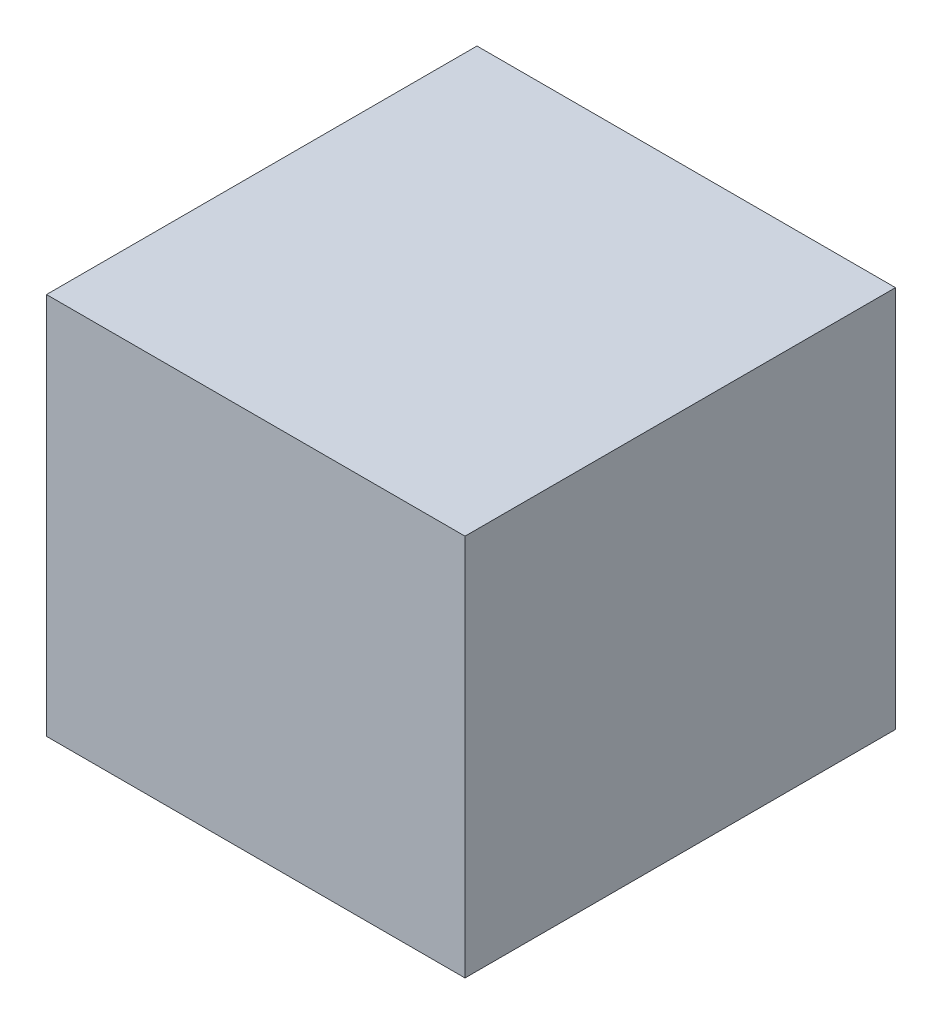
ISO-10303-21;
HEADER;
FILE_DESCRIPTION(('STEP AP214'),'2;1');
FILE_NAME('part.step','',(''),(''),'','','');
FILE_SCHEMA(('AUTOMOTIVE_DESIGN { 1 0 10303 214 1 1 1 1 }'));
ENDSEC;
DATA;
#1=APPLICATION_CONTEXT('core data for automotive mechanical design processes');
#2=APPLICATION_PROTOCOL_DEFINITION('international standard','automotive_design',2000,#1);
#3=PRODUCT_CONTEXT('',#1,'mechanical');
#4=PRODUCT('Part','Part','',(#3));
#5=PRODUCT_RELATED_PRODUCT_CATEGORY('part','',(#4));
#6=PRODUCT_DEFINITION_FORMATION('','',#4);
#7=PRODUCT_DEFINITION_CONTEXT('part definition',#1,'design');
#8=PRODUCT_DEFINITION('design','',#6,#7);
#9=PRODUCT_DEFINITION_SHAPE('','',#8);
#10=(LENGTH_UNIT() NAMED_UNIT(*) SI_UNIT(.MILLI.,.METRE.));
#11=(NAMED_UNIT(*) PLANE_ANGLE_UNIT() SI_UNIT($,.RADIAN.));
#12=(NAMED_UNIT(*) SI_UNIT($,.STERADIAN.) SOLID_ANGLE_UNIT());
#13=UNCERTAINTY_MEASURE_WITH_UNIT(LENGTH_MEASURE(1.E-05),#10,'distance_accuracy_value','');
#14=(GEOMETRIC_REPRESENTATION_CONTEXT(3) GLOBAL_UNCERTAINTY_ASSIGNED_CONTEXT((#13)) GLOBAL_UNIT_ASSIGNED_CONTEXT((#10,
#11,#12)) REPRESENTATION_CONTEXT('',''));
#15=CARTESIAN_POINT('',(0.,0.,0.));
#16=DIRECTION('',(0.,0.,1.));
#17=DIRECTION('',(1.,0.,0.));
#18=AXIS2_PLACEMENT_3D('',#15,#16,#17);
#19=CARTESIAN_POINT('',(0.,-13.5,18.));
#20=DIRECTION('',(0.,1.,0.));
#21=DIRECTION('',(0.,0.,1.));
#22=AXIS2_PLACEMENT_3D('',#19,#20,#21);
#23=CYLINDRICAL_SURFACE('',#22,5.);
#24=CARTESIAN_POINT('',(0.,13.5,18.));
#25=DIRECTION('',(0.,1.,0.));
#26=DIRECTION('',(0.,0.,1.));
#27=AXIS2_PLACEMENT_3D('',#24,#25,#26);
#28=CIRCLE('',#27,5.);
#29=CARTESIAN_POINT('',(0.,13.5,23.));
#30=VERTEX_POINT('',#29);
#31=EDGE_CURVE('E104',#30,#30,#28,.T.);
#32=ORIENTED_EDGE('',*,*,#31,.T.);
#33=EDGE_LOOP('',(#32));
#34=FACE_BOUND('',#33,.T.);
#35=CARTESIAN_POINT('',(0.,-10.,18.));
#36=DIRECTION('',(0.,-1.,0.));
#37=DIRECTION('',(0.,0.,-1.));
#38=AXIS2_PLACEMENT_3D('',#35,#36,#37);
#39=CIRCLE('',#38,5.);
#40=CARTESIAN_POINT('',(0.,-10.,13.));
#41=VERTEX_POINT('',#40);
#42=EDGE_CURVE('E41',#41,#41,#39,.F.);
#43=ORIENTED_EDGE('',*,*,#42,.F.);
#44=EDGE_LOOP('',(#43));
#45=FACE_BOUND('',#44,.T.);
#46=ADVANCED_FACE('F37',(#34,#45),#23,.F.);
#47=CARTESIAN_POINT('',(17.5,13.5,36.));
#48=DIRECTION('',(-1.,0.,0.));
#49=DIRECTION('',(0.,-1.,0.));
#50=AXIS2_PLACEMENT_3D('',#47,#48,#49);
#51=PLANE('',#50);
#52=DIRECTION('',(0.,1.,0.));
#53=VECTOR('',#52,1.);
#54=CARTESIAN_POINT('',(17.5,13.5,0.));
#55=LINE('',#54,#53);
#56=CARTESIAN_POINT('',(17.5,-13.5,0.));
#57=VERTEX_POINT('',#56);
#58=CARTESIAN_POINT('',(17.5,18.5,0.));
#59=VERTEX_POINT('',#58);
#60=EDGE_CURVE('E84',#57,#59,#55,.T.);
#61=ORIENTED_EDGE('',*,*,#60,.T.);
#62=DIRECTION('',(0.,0.,-1.));
#63=VECTOR('',#62,1.);
#64=CARTESIAN_POINT('',(17.5,18.5,0.));
#65=LINE('',#64,#63);
#66=CARTESIAN_POINT('',(17.5,18.5,36.));
#67=VERTEX_POINT('',#66);
#68=EDGE_CURVE('E87',#67,#59,#65,.T.);
#69=ORIENTED_EDGE('',*,*,#68,.F.);
#70=DIRECTION('',(0.,1.,0.));
#71=VECTOR('',#70,1.);
#72=CARTESIAN_POINT('',(17.5,13.5,36.));
#73=LINE('',#72,#71);
#74=CARTESIAN_POINT('',(17.5,-13.5,36.));
#75=VERTEX_POINT('',#74);
#76=EDGE_CURVE('E71',#75,#67,#73,.T.);
#77=ORIENTED_EDGE('',*,*,#76,.F.);
#78=DIRECTION('',(0.,0.,-1.));
#79=VECTOR('',#78,1.);
#80=CARTESIAN_POINT('',(17.5,-13.5,36.));
#81=LINE('',#80,#79);
#82=EDGE_CURVE('E47',#75,#57,#81,.T.);
#83=ORIENTED_EDGE('',*,*,#82,.T.);
#84=EDGE_LOOP('',(#61,#69,#77,#83));
#85=FACE_BOUND('',#84,.T.);
#86=ADVANCED_FACE('F39',(#85),#51,.F.);
#87=CARTESIAN_POINT('',(-17.5,13.5,36.));
#88=DIRECTION('',(1.,0.,0.));
#89=DIRECTION('',(0.,1.,0.));
#90=AXIS2_PLACEMENT_3D('',#87,#88,#89);
#91=PLANE('',#90);
#92=DIRECTION('',(0.,-1.,0.));
#93=VECTOR('',#92,1.);
#94=CARTESIAN_POINT('',(-17.5,13.5,0.));
#95=LINE('',#94,#93);
#96=CARTESIAN_POINT('',(-17.5,18.5,0.));
#97=VERTEX_POINT('',#96);
#98=CARTESIAN_POINT('',(-17.5,-13.5,0.));
#99=VERTEX_POINT('',#98);
#100=EDGE_CURVE('E66',#97,#99,#95,.T.);
#101=ORIENTED_EDGE('',*,*,#100,.T.);
#102=DIRECTION('',(0.,0.,-1.));
#103=VECTOR('',#102,1.);
#104=CARTESIAN_POINT('',(-17.5,-13.5,36.));
#105=LINE('',#104,#103);
#106=CARTESIAN_POINT('',(-17.5,-13.5,36.));
#107=VERTEX_POINT('',#106);
#108=EDGE_CURVE('E11',#107,#99,#105,.T.);
#109=ORIENTED_EDGE('',*,*,#108,.F.);
#110=DIRECTION('',(0.,-1.,0.));
#111=VECTOR('',#110,1.);
#112=CARTESIAN_POINT('',(-17.5,13.5,36.));
#113=LINE('',#112,#111);
#114=CARTESIAN_POINT('',(-17.5,18.5,36.));
#115=VERTEX_POINT('',#114);
#116=EDGE_CURVE('E114',#115,#107,#113,.T.);
#117=ORIENTED_EDGE('',*,*,#116,.F.);
#118=DIRECTION('',(0.,0.,1.));
#119=VECTOR('',#118,1.);
#120=CARTESIAN_POINT('',(-17.5,18.5,0.));
#121=LINE('',#120,#119);
#122=EDGE_CURVE('E96',#97,#115,#121,.T.);
#123=ORIENTED_EDGE('',*,*,#122,.F.);
#124=EDGE_LOOP('',(#101,#109,#117,#123));
#125=FACE_BOUND('',#124,.T.);
#126=ADVANCED_FACE('F122',(#125),#91,.F.);
#127=CARTESIAN_POINT('',(-17.5,-13.5,36.));
#128=DIRECTION('',(0.,1.,0.));
#129=DIRECTION('',(0.,0.,1.));
#130=AXIS2_PLACEMENT_3D('',#127,#128,#129);
#131=PLANE('',#130);
#132=CARTESIAN_POINT('',(0.,-13.5,18.));
#133=DIRECTION('',(0.,-1.,0.));
#134=DIRECTION('',(0.,0.,-1.));
#135=AXIS2_PLACEMENT_3D('',#132,#133,#134);
#136=CIRCLE('',#135,11.);
#137=CARTESIAN_POINT('',(0.,-13.5,7.00000000000001));
#138=VERTEX_POINT('',#137);
#139=EDGE_CURVE('E108',#138,#138,#136,.T.);
#140=ORIENTED_EDGE('',*,*,#139,.F.);
#141=EDGE_LOOP('',(#140));
#142=FACE_BOUND('',#141,.T.);
#143=DIRECTION('',(1.,0.,0.));
#144=VECTOR('',#143,1.);
#145=CARTESIAN_POINT('',(-17.5,-13.5,0.));
#146=LINE('',#145,#144);
#147=EDGE_CURVE('E115',#99,#57,#146,.T.);
#148=ORIENTED_EDGE('',*,*,#147,.T.);
#149=ORIENTED_EDGE('',*,*,#82,.F.);
#150=DIRECTION('',(1.,0.,0.));
#151=VECTOR('',#150,1.);
#152=CARTESIAN_POINT('',(-17.5,-13.5,36.));
#153=LINE('',#152,#151);
#154=EDGE_CURVE('E55',#107,#75,#153,.T.);
#155=ORIENTED_EDGE('',*,*,#154,.F.);
#156=ORIENTED_EDGE('',*,*,#108,.T.);
#157=EDGE_LOOP('',(#148,#149,#155,#156));
#158=FACE_BOUND('',#157,.T.);
#159=ADVANCED_FACE('F121',(#142,#158),#131,.F.);
#160=CARTESIAN_POINT('',(0.,0.,36.));
#161=DIRECTION('',(0.,0.,1.));
#162=DIRECTION('',(1.,0.,0.));
#163=AXIS2_PLACEMENT_3D('',#160,#161,#162);
#164=PLANE('',#163);
#165=ORIENTED_EDGE('',*,*,#76,.T.);
#166=DIRECTION('',(1.,0.,0.));
#167=VECTOR('',#166,1.);
#168=CARTESIAN_POINT('',(-17.5,18.5,36.));
#169=LINE('',#168,#167);
#170=EDGE_CURVE('E99',#115,#67,#169,.T.);
#171=ORIENTED_EDGE('',*,*,#170,.F.);
#172=ORIENTED_EDGE('',*,*,#116,.T.);
#173=ORIENTED_EDGE('',*,*,#154,.T.);
#174=EDGE_LOOP('',(#165,#171,#172,#173));
#175=FACE_BOUND('',#174,.T.);
#176=ADVANCED_FACE('F123',(#175),#164,.T.);
#177=CARTESIAN_POINT('',(0.,0.,0.));
#178=DIRECTION('',(0.,0.,1.));
#179=DIRECTION('',(1.,0.,0.));
#180=AXIS2_PLACEMENT_3D('',#177,#178,#179);
#181=PLANE('',#180);
#182=ORIENTED_EDGE('',*,*,#60,.F.);
#183=ORIENTED_EDGE('',*,*,#147,.F.);
#184=ORIENTED_EDGE('',*,*,#100,.F.);
#185=DIRECTION('',(-1.,0.,0.));
#186=VECTOR('',#185,1.);
#187=CARTESIAN_POINT('',(-17.5,18.5,0.));
#188=LINE('',#187,#186);
#189=EDGE_CURVE('E92',#59,#97,#188,.T.);
#190=ORIENTED_EDGE('',*,*,#189,.F.);
#191=EDGE_LOOP('',(#182,#183,#184,#190));
#192=FACE_BOUND('',#191,.T.);
#193=ADVANCED_FACE('F93',(#192),#181,.F.);
#194=CARTESIAN_POINT('',(0.,-10.,18.));
#195=DIRECTION('',(0.,-1.,0.));
#196=DIRECTION('',(0.,0.,-1.));
#197=AXIS2_PLACEMENT_3D('',#194,#195,#196);
#198=PLANE('',#197);
#199=CARTESIAN_POINT('',(0.,-10.,18.));
#200=DIRECTION('',(0.,-1.,0.));
#201=DIRECTION('',(0.,0.,-1.));
#202=AXIS2_PLACEMENT_3D('',#199,#200,#201);
#203=CIRCLE('',#202,11.);
#204=CARTESIAN_POINT('',(0.,-10.,7.00000000000001));
#205=VERTEX_POINT('',#204);
#206=EDGE_CURVE('E105',#205,#205,#203,.T.);
#207=ORIENTED_EDGE('',*,*,#206,.T.);
#208=EDGE_LOOP('',(#207));
#209=FACE_BOUND('',#208,.T.);
#210=ORIENTED_EDGE('',*,*,#42,.T.);
#211=EDGE_LOOP('',(#210));
#212=FACE_BOUND('',#211,.T.);
#213=ADVANCED_FACE('F130',(#209,#212),#198,.T.);
#214=CARTESIAN_POINT('',(0.,-10.,18.));
#215=DIRECTION('',(0.,-1.,0.));
#216=DIRECTION('',(0.,0.,-1.));
#217=AXIS2_PLACEMENT_3D('',#214,#215,#216);
#218=CYLINDRICAL_SURFACE('',#217,11.);
#219=ORIENTED_EDGE('',*,*,#206,.F.);
#220=EDGE_LOOP('',(#219));
#221=FACE_BOUND('',#220,.T.);
#222=ORIENTED_EDGE('',*,*,#139,.T.);
#223=EDGE_LOOP('',(#222));
#224=FACE_BOUND('',#223,.T.);
#225=ADVANCED_FACE('F142',(#221,#224),#218,.F.);
#226=CARTESIAN_POINT('',(0.,13.5,0.));
#227=DIRECTION('',(0.,1.,0.));
#228=DIRECTION('',(0.,0.,1.));
#229=AXIS2_PLACEMENT_3D('',#226,#227,#228);
#230=PLANE('',#229);
#231=ORIENTED_EDGE('',*,*,#31,.F.);
#232=EDGE_LOOP('',(#231));
#233=FACE_BOUND('',#232,.T.);
#234=ADVANCED_FACE('F145',(#233),#230,.F.);
#235=CARTESIAN_POINT('',(0.,18.5,0.));
#236=DIRECTION('',(0.,1.,0.));
#237=DIRECTION('',(0.,0.,1.));
#238=AXIS2_PLACEMENT_3D('',#235,#236,#237);
#239=PLANE('',#238);
#240=ORIENTED_EDGE('',*,*,#68,.T.);
#241=ORIENTED_EDGE('',*,*,#189,.T.);
#242=ORIENTED_EDGE('',*,*,#122,.T.);
#243=ORIENTED_EDGE('',*,*,#170,.T.);
#244=EDGE_LOOP('',(#240,#241,#242,#243));
#245=FACE_BOUND('',#244,.T.);
#246=ADVANCED_FACE('F98',(#245),#239,.T.);
#247=CLOSED_SHELL('',(#46,#86,#126,#159,#176,#193,#213,#225,#234,#246));
#248=MANIFOLD_SOLID_BREP('B2',#247);
#249=ADVANCED_BREP_SHAPE_REPRESENTATION('',(#18,#248),#14);
#250=SHAPE_DEFINITION_REPRESENTATION(#9,#249);
ENDSEC;
END-ISO-10303-21;
